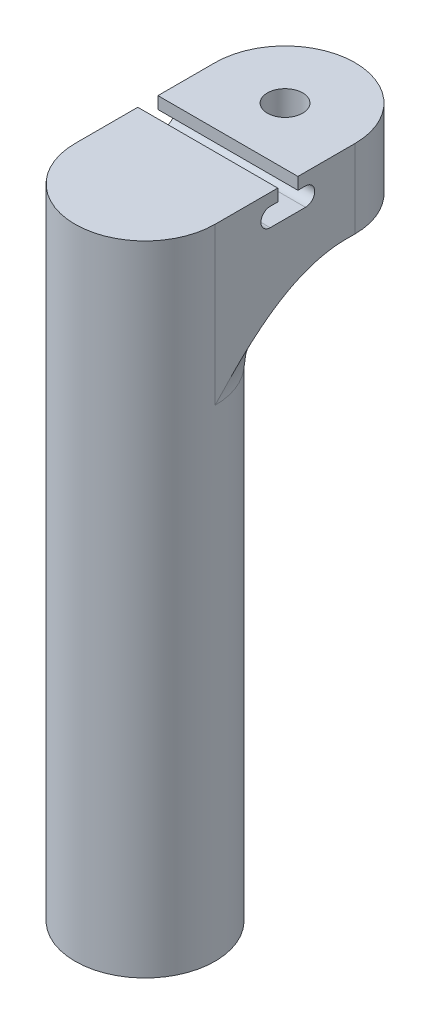
ISO-10303-21;
HEADER;
FILE_DESCRIPTION(('STEP AP214'),'2;1');
FILE_NAME('part.step','',(''),(''),'','','');
FILE_SCHEMA(('AUTOMOTIVE_DESIGN { 1 0 10303 214 1 1 1 1 }'));
ENDSEC;
DATA;
#1=APPLICATION_CONTEXT('core data for automotive mechanical design processes');
#2=APPLICATION_PROTOCOL_DEFINITION('international standard','automotive_design',2000,#1);
#3=PRODUCT_CONTEXT('',#1,'mechanical');
#4=PRODUCT('Part','Part','',(#3));
#5=PRODUCT_RELATED_PRODUCT_CATEGORY('part','',(#4));
#6=PRODUCT_DEFINITION_FORMATION('','',#4);
#7=PRODUCT_DEFINITION_CONTEXT('part definition',#1,'design');
#8=PRODUCT_DEFINITION('design','',#6,#7);
#9=PRODUCT_DEFINITION_SHAPE('','',#8);
#10=(LENGTH_UNIT() NAMED_UNIT(*) SI_UNIT(.MILLI.,.METRE.));
#11=(NAMED_UNIT(*) PLANE_ANGLE_UNIT() SI_UNIT($,.RADIAN.));
#12=(NAMED_UNIT(*) SI_UNIT($,.STERADIAN.) SOLID_ANGLE_UNIT());
#13=UNCERTAINTY_MEASURE_WITH_UNIT(LENGTH_MEASURE(1.E-05),#10,'distance_accuracy_value','');
#14=(GEOMETRIC_REPRESENTATION_CONTEXT(3) GLOBAL_UNCERTAINTY_ASSIGNED_CONTEXT((#13)) GLOBAL_UNIT_ASSIGNED_CONTEXT((#10,
#11,#12)) REPRESENTATION_CONTEXT('',''));
#15=CARTESIAN_POINT('',(0.,0.,0.));
#16=DIRECTION('',(0.,0.,1.));
#17=DIRECTION('',(1.,0.,0.));
#18=AXIS2_PLACEMENT_3D('',#15,#16,#17);
#19=CARTESIAN_POINT('',(0.,86.,0.));
#20=DIRECTION('',(0.,1.,0.));
#21=DIRECTION('',(0.,0.,1.));
#22=AXIS2_PLACEMENT_3D('',#19,#20,#21);
#23=TOROIDAL_SURFACE('',#22,26.5,14.);
#24=CARTESIAN_POINT('',(5.04907796508432,100.,-26.01455));
#25=CARTESIAN_POINT('',(5.0762610661496,100.000013742848,-25.8793666272089));
#26=CARTESIAN_POINT('',(5.09797845416889,99.9982581936895,-25.7430814367185));
#27=CARTESIAN_POINT('',(5.13041814636234,99.9909821859019,-25.4693141202181));
#28=CARTESIAN_POINT('',(5.14114088044935,99.985461874497,-25.3318320412208));
#29=CARTESIAN_POINT('',(5.15151783876317,99.9704472773671,-25.0569822148479));
#30=CARTESIAN_POINT('',(5.15119737223602,99.9609621277391,-24.9196149274924));
#31=CARTESIAN_POINT('',(5.13962580898109,99.9379034955453,-24.6456917861143));
#32=CARTESIAN_POINT('',(5.12837507151366,99.9243301473621,-24.5091359055705));
#33=CARTESIAN_POINT('',(5.09511587383147,99.8930665639615,-24.2377747547514));
#34=CARTESIAN_POINT('',(5.07310400591769,99.8753750255778,-24.1029700529081));
#35=CARTESIAN_POINT('',(5.01859366287669,99.8359511898401,-23.8360500431003));
#36=CARTESIAN_POINT('',(4.9860912943574,99.8142173935336,-23.703935753025));
#37=CARTESIAN_POINT('',(4.91098643654079,99.7669063989532,-23.4433721167089));
#38=CARTESIAN_POINT('',(4.86838747897529,99.7413305457528,-23.3149215064952));
#39=CARTESIAN_POINT('',(4.77350411005985,99.6866046518461,-23.0623824547448));
#40=CARTESIAN_POINT('',(4.72121594660065,99.6574532279968,-22.9382957253286));
#41=CARTESIAN_POINT('',(4.60644734365933,99.5954225166922,-22.6931000199819));
#42=CARTESIAN_POINT('',(4.5438039178149,99.5624867137839,-22.5720817130063));
#43=CARTESIAN_POINT('',(4.40950702574477,99.4937951955356,-22.3359419367481));
#44=CARTESIAN_POINT('',(4.33785050991832,99.4580385272827,-22.2208224819986));
#45=CARTESIAN_POINT('',(4.18604588570146,99.3842790838464,-21.9970334312833));
#46=CARTESIAN_POINT('',(4.10589502739516,99.3462755830558,-21.8883659419172));
#47=CARTESIAN_POINT('',(3.9376229174457,99.2686862534208,-21.6779866422301));
#48=CARTESIAN_POINT('',(3.84950113308384,99.2291003189169,-21.5762752976062));
#49=CARTESIAN_POINT('',(3.65833837011382,99.1458426192627,-21.3723089843838));
#50=CARTESIAN_POINT('',(3.5546672792183,99.1020990155495,-21.2706731247351));
#51=CARTESIAN_POINT('',(3.33915165992659,99.0146442732805,-21.0765325859229));
#52=CARTESIAN_POINT('',(3.22730947695518,98.9709331290183,-20.9840253042805));
#53=CARTESIAN_POINT('',(2.99583153358104,98.8846065117208,-20.8085076090868));
#54=CARTESIAN_POINT('',(2.8761889419204,98.8419920459172,-20.725505700115));
#55=CARTESIAN_POINT('',(2.62969022900545,98.7591108403304,-20.5695936941485));
#56=CARTESIAN_POINT('',(2.50283292033246,98.7188444892282,-20.4966852651882));
#57=CARTESIAN_POINT('',(2.23801312364748,98.6406559199613,-20.3592235380573));
#58=CARTESIAN_POINT('',(2.09981907177053,98.6028612719605,-20.2950420565776));
#59=CARTESIAN_POINT('',(1.81716043847567,98.5327203298068,-20.1788217103962));
#60=CARTESIAN_POINT('',(1.67269952146076,98.5003709042857,-20.1267758602121));
#61=CARTESIAN_POINT('',(1.37865289791335,98.4426306820277,-20.0355796815317));
#62=CARTESIAN_POINT('',(1.22907579898188,98.41722878754,-19.9964087666122));
#63=CARTESIAN_POINT('',(0.925885177684394,98.3746538576017,-19.9315436164633));
#64=CARTESIAN_POINT('',(0.772272665688989,98.3574787826807,-19.9058460409747));
#65=CARTESIAN_POINT('',(0.484139011877502,98.3340901549833,-19.8710479531772));
#66=CARTESIAN_POINT('',(0.349930575093664,98.3266851944806,-19.860137569578));
#67=CARTESIAN_POINT('',(0.0808710654441896,98.3190402066997,-19.8488755998125));
#68=CARTESIAN_POINT('',(-0.0539799421153995,98.3187994662087,-19.848522962601));
#69=CARTESIAN_POINT('',(-0.32310677587289,98.3254944726485,-19.8583819923226));
#70=CARTESIAN_POINT('',(-0.457382618762349,98.3324300098838,-19.868593350569));
#71=CARTESIAN_POINT('',(-0.724193169335582,98.3531574089899,-19.8994039785459));
#72=CARTESIAN_POINT('',(-0.85672790037204,98.3669491788048,-19.9200031088041));
#73=CARTESIAN_POINT('',(-1.10554575026102,98.3990492749911,-19.9686335039564));
#74=CARTESIAN_POINT('',(-1.22210109300132,98.4167489997262,-19.9956853575475));
#75=CARTESIAN_POINT('',(-1.45235560036544,98.4566079591168,-20.0575924987316));
#76=CARTESIAN_POINT('',(-1.56605383282588,98.4787686284897,-20.0924502972589));
#77=CARTESIAN_POINT('',(-1.90200115469982,98.550967686065,-20.2082431897258));
#78=CARTESIAN_POINT('',(-2.1192439171723,98.6067426302949,-20.3004258177189));
#79=CARTESIAN_POINT('',(-2.5620413342218,98.7352667643654,-20.5248049540764));
#80=CARTESIAN_POINT('',(-2.78544905887181,98.8092510096401,-20.6604822302676));
#81=CARTESIAN_POINT('',(-3.2084136442203,98.9621025601692,-20.963145653143));
#82=CARTESIAN_POINT('',(-3.40795156076627,99.0409736694908,-21.1301564010346));
#83=CARTESIAN_POINT('',(-3.7002452709909,99.163714412512,-21.4149239570015));
#84=CARTESIAN_POINT('',(-3.80217540633639,99.2081288148149,-21.5232025290608));
#85=CARTESIAN_POINT('',(-3.99655449512563,99.2954312446224,-21.7485129989775));
#86=CARTESIAN_POINT('',(-4.08900644024411,99.3383197509491,-21.8655421145384));
#87=CARTESIAN_POINT('',(-4.26378162706849,99.4216457749782,-22.1077729337814));
#88=CARTESIAN_POINT('',(-4.34610378585232,99.4620830303964,-22.232975509059));
#89=CARTESIAN_POINT('',(-4.49987356086748,99.5396733186006,-22.490786741355));
#90=CARTESIAN_POINT('',(-4.57132601376392,99.5768278090068,-22.623392068272));
#91=CARTESIAN_POINT('',(-4.70198798278653,99.6468110849585,-22.8937907306793));
#92=CARTESIAN_POINT('',(-4.76131818466688,99.6796811982648,-23.031514963027));
#93=CARTESIAN_POINT('',(-4.8679960286818,99.7410115111176,-23.312488896303));
#94=CARTESIAN_POINT('',(-4.91534348044815,99.7694716406005,-23.4557386849733));
#95=CARTESIAN_POINT('',(-4.99743752761666,99.8215816779277,-23.7466243321889));
#96=CARTESIAN_POINT('',(-5.03218709860086,99.8452327210836,-23.8942591460792));
#97=CARTESIAN_POINT('',(-5.08859924602115,99.887493850556,-24.1927108574004));
#98=CARTESIAN_POINT('',(-5.11026308981515,99.9061044249475,-24.3435274452106));
#99=CARTESIAN_POINT('',(-5.13890400867794,99.9368702741881,-24.6343497585326));
#100=CARTESIAN_POINT('',(-5.14695571704122,99.9494346074757,-24.774207524604));
#101=CARTESIAN_POINT('',(-5.15161866086922,99.970326520927,-25.0544280024545));
#102=CARTESIAN_POINT('',(-5.14823034109799,99.9786542657858,-25.1947906943912));
#103=CARTESIAN_POINT('',(-5.12995286320665,99.9912423899475,-25.4752466552403));
#104=CARTESIAN_POINT('',(-5.11503918379695,99.995494053736,-25.6153387104574));
#105=CARTESIAN_POINT('',(-5.07378667716049,100.000170426364,-25.8939086468126));
#106=CARTESIAN_POINT('',(-5.04744681989643,100.000594790107,-26.0323863812686));
#107=CARTESIAN_POINT('',(-5.01544786119926,99.999240784892,-26.1695224459547));
#108=B_SPLINE_CURVE_WITH_KNOTS('',3,(#24,#25,#26,#27,#28,#29,#30,#31,#32,#33,#34,#35,#36,#37,
#38,#39,#40,#41,#42,#43,#44,#45,#46,#47,#48,#49,#50,#51,#52,#53,#54,#55,#56,#57,#58,#59,#60,#61,
#62,#63,#64,#65,#66,#67,#68,#69,#70,#71,#72,#73,#74,#75,#76,#77,#78,#79,#80,#81,#82,#83,#84,#85,
#86,#87,#88,#89,#90,#91,#92,#93,#94,#95,#96,#97,#98,#99,#100,#101,#102,#103,#104,#105,#106,
#107),.UNSPECIFIED.,.F.,.F.,(4,2,2,2,2,2,2,2,2,2,2,2,2,2,2,2,2,2,2,2,2,2,2,2,2,2,2,2,2,2,2,2,2,
2,2,2,2,2,2,2,2,4),(0.,0.413549712994737,0.827083254756278,1.23966910708221,1.65224139883685,
2.06494442348922,2.4778007931493,2.89051296048116,3.30338528434379,3.72351423030304,
4.14378571223211,4.56419366877957,4.98462974312573,5.43901050828138,5.8932613568668,
6.34791550566108,6.80264470050056,7.27295270693983,7.74298932381497,8.21227067583405,
8.68143563032241,9.08541730432539,9.48935876099248,9.89328841456435,10.2972126448821,
10.6596931340014,11.0222903899543,11.7470540737806,12.5590545255424,13.3716952009607,
13.8368274364149,14.3018124036163,14.7668470368036,15.2316741356259,15.6916200068215,
16.1515731846527,16.6114176520191,17.0712175761207,17.4926518754042,17.9140697904033,
18.3363867885636,18.7587418653092),.UNSPECIFIED.);
#109=CARTESIAN_POINT('',(5.04907796508432,100.,-26.01455));
#110=VERTEX_POINT('',#109);
#111=CARTESIAN_POINT('',(-5.04907796508432,100.,-26.01455));
#112=VERTEX_POINT('',#111);
#113=EDGE_CURVE('E360',#110,#112,#108,.T.);
#114=ORIENTED_EDGE('',*,*,#113,.F.);
#115=CARTESIAN_POINT('',(0.,100.,0.));
#116=DIRECTION('',(0.,1.,0.));
#117=DIRECTION('',(0.,0.,1.));
#118=AXIS2_PLACEMENT_3D('',#115,#116,#117);
#119=CIRCLE('',#118,26.5);
#120=CARTESIAN_POINT('',(12.5,100.,-23.3666428910959));
#121=VERTEX_POINT('',#120);
#122=EDGE_CURVE('E351',#121,#110,#119,.T.);
#123=ORIENTED_EDGE('',*,*,#122,.F.);
#124=CARTESIAN_POINT('',(12.5,100.,-23.3666428910959));
#125=CARTESIAN_POINT('',(12.5,100.000001251155,-23.083094663131));
#126=CARTESIAN_POINT('',(12.5,99.9933015505005,-22.7995977515363));
#127=CARTESIAN_POINT('',(12.5,99.9668587758662,-22.2332541391649));
#128=CARTESIAN_POINT('',(12.5,99.9471177133723,-21.9504073448651));
#129=CARTESIAN_POINT('',(12.5,99.868947869374,-21.1044079620911));
#130=CARTESIAN_POINT('',(12.5,99.7915701563818,-20.5429135353648));
#131=CARTESIAN_POINT('',(12.5,99.5907097181542,-19.4347930296872));
#132=CARTESIAN_POINT('',(12.5,99.4677445888395,-18.8880712832982));
#133=CARTESIAN_POINT('',(12.5,99.1791337740243,-17.8058418733705));
#134=CARTESIAN_POINT('',(12.5,99.0134695554496,-17.2703391887479));
#135=CARTESIAN_POINT('',(12.5,98.5804354497702,-16.033851870729));
#136=CARTESIAN_POINT('',(12.5,98.2976229725125,-15.3382595684696));
#137=CARTESIAN_POINT('',(12.5,97.6713158543407,-13.9750568846442));
#138=CARTESIAN_POINT('',(12.5,97.3278047568973,-13.3074541524593));
#139=CARTESIAN_POINT('',(12.5,96.5876480463145,-11.9989205722143));
#140=CARTESIAN_POINT('',(12.5,96.1907869070001,-11.3581125089503));
#141=CARTESIAN_POINT('',(12.5,95.3536386394992,-10.1053739516389));
#142=CARTESIAN_POINT('',(12.5,94.9133352967001,-9.49345436704268));
#143=CARTESIAN_POINT('',(12.5,94.1449386346151,-8.4891521865242));
#144=CARTESIAN_POINT('',(12.5,93.826298261986,-8.08945587405815));
#145=CARTESIAN_POINT('',(12.5,93.1753239536066,-7.30155658067723));
#146=CARTESIAN_POINT('',(12.5,92.8429933338274,-6.91335085527519));
#147=CARTESIAN_POINT('',(12.5,91.8284903212038,-5.76372325645531));
#148=CARTESIAN_POINT('',(12.5,91.1290246427347,-5.01756996980459));
#149=CARTESIAN_POINT('',(12.5,88.9877594848668,-2.82367715175982));
#150=CARTESIAN_POINT('',(12.5,87.5022659214507,-1.41950982944029));
#151=CARTESIAN_POINT('',(12.5,86.0114668325127,-0.0108351372254986));
#152=CARTESIAN_POINT('',(12.5,86.0057334113781,-0.00541756347535301));
#153=CARTESIAN_POINT('',(12.5,86.,0.));
#154=B_SPLINE_CURVE_WITH_KNOTS('',3,(#124,#125,#126,#127,#128,#129,#130,#131,#132,#133,#134,
#135,#136,#137,#138,#139,#140,#141,#142,#143,#144,#145,#146,#147,#148,#149,#150,#151,#152,#153),
.UNSPECIFIED.,.F.,.F.,(4,2,2,2,2,2,2,2,2,2,2,2,2,2,4),(0.,0.850472118412875,1.70081309151973,
3.39885641928183,5.07818297997625,6.75823966511301,9.00741190393508,11.2571948735966,
13.5163562394423,15.7763640404441,17.309545004503,18.8423567691994,21.9090402918385,
28.0385444440093,28.0622087631415),.UNSPECIFIED.);
#155=CARTESIAN_POINT('',(12.5,86.,0.));
#156=VERTEX_POINT('',#155);
#157=EDGE_CURVE('E52',#121,#156,#154,.T.);
#158=ORIENTED_EDGE('',*,*,#157,.T.);
#159=CARTESIAN_POINT('',(0.,86.,0.));
#160=DIRECTION('',(0.,1.,0.));
#161=DIRECTION('',(0.,0.,1.));
#162=AXIS2_PLACEMENT_3D('',#159,#160,#161);
#163=CIRCLE('',#162,12.5);
#164=CARTESIAN_POINT('',(2.38164054956808,86.,-12.2710141509434));
#165=VERTEX_POINT('',#164);
#166=EDGE_CURVE('E66',#165,#156,#163,.F.);
#167=ORIENTED_EDGE('',*,*,#166,.F.);
#168=CARTESIAN_POINT('',(0.,86.,0.));
#169=DIRECTION('',(0.,1.,0.));
#170=DIRECTION('',(0.,0.,1.));
#171=AXIS2_PLACEMENT_3D('',#168,#169,#170);
#172=CIRCLE('',#171,12.5);
#173=CARTESIAN_POINT('',(-12.5,86.,0.));
#174=VERTEX_POINT('',#173);
#175=EDGE_CURVE('E355',#174,#165,#172,.F.);
#176=ORIENTED_EDGE('',*,*,#175,.F.);
#177=CARTESIAN_POINT('',(-12.5,100.,-23.3666428910959));
#178=CARTESIAN_POINT('',(-12.5,100.000001251155,-23.083094663131));
#179=CARTESIAN_POINT('',(-12.5,99.9933015505005,-22.7995977515363));
#180=CARTESIAN_POINT('',(-12.5,99.9668587758662,-22.2332541391649));
#181=CARTESIAN_POINT('',(-12.5,99.9471177133723,-21.9504073448651));
#182=CARTESIAN_POINT('',(-12.5,99.868947869374,-21.1044079620911));
#183=CARTESIAN_POINT('',(-12.5,99.7915701563818,-20.5429135353648));
#184=CARTESIAN_POINT('',(-12.5,99.5907097181542,-19.4347930296872));
#185=CARTESIAN_POINT('',(-12.5,99.4677445888395,-18.8880712832982));
#186=CARTESIAN_POINT('',(-12.5,99.1791337740243,-17.8058418733705));
#187=CARTESIAN_POINT('',(-12.5,99.0134695554496,-17.2703391887479));
#188=CARTESIAN_POINT('',(-12.5,98.5804354497702,-16.033851870729));
#189=CARTESIAN_POINT('',(-12.5,98.2976229725125,-15.3382595684696));
#190=CARTESIAN_POINT('',(-12.5,97.6713158543407,-13.9750568846442));
#191=CARTESIAN_POINT('',(-12.5,97.3278047568973,-13.3074541524593));
#192=CARTESIAN_POINT('',(-12.5,96.5876480463145,-11.9989205722143));
#193=CARTESIAN_POINT('',(-12.5,96.1907869070001,-11.3581125089503));
#194=CARTESIAN_POINT('',(-12.5,95.3536386394992,-10.1053739516389));
#195=CARTESIAN_POINT('',(-12.5,94.9133352967001,-9.49345436704268));
#196=CARTESIAN_POINT('',(-12.5,94.1449386346151,-8.4891521865242));
#197=CARTESIAN_POINT('',(-12.5,93.826298261986,-8.08945587405815));
#198=CARTESIAN_POINT('',(-12.5,93.1753239536066,-7.30155658067723));
#199=CARTESIAN_POINT('',(-12.5,92.8429933338274,-6.91335085527519));
#200=CARTESIAN_POINT('',(-12.5,91.8284903212038,-5.76372325645531));
#201=CARTESIAN_POINT('',(-12.5,91.1290246427347,-5.01756996980459));
#202=CARTESIAN_POINT('',(-12.5,88.9877594848668,-2.82367715175982));
#203=CARTESIAN_POINT('',(-12.5,87.5022659214507,-1.41950982944029));
#204=CARTESIAN_POINT('',(-12.5,86.0114668325127,-0.0108351372254986));
#205=CARTESIAN_POINT('',(-12.5,86.0057334113781,-0.00541756347535301));
#206=CARTESIAN_POINT('',(-12.5,86.,0.));
#207=B_SPLINE_CURVE_WITH_KNOTS('',3,(#177,#178,#179,#180,#181,#182,#183,#184,#185,#186,#187,
#188,#189,#190,#191,#192,#193,#194,#195,#196,#197,#198,#199,#200,#201,#202,#203,#204,#205,#206),
.UNSPECIFIED.,.F.,.F.,(4,2,2,2,2,2,2,2,2,2,2,2,2,2,4),(0.,0.850472118412875,1.70081309151973,
3.39885641928183,5.07818297997625,6.75823966511301,9.00741190393508,11.2571948735966,
13.5163562394423,15.7763640404441,17.309545004503,18.8423567691994,21.9090402918385,
28.0385444440093,28.0622087631415),.UNSPECIFIED.);
#208=CARTESIAN_POINT('',(-12.5,100.,-23.3666428910959));
#209=VERTEX_POINT('',#208);
#210=EDGE_CURVE('E11',#174,#209,#207,.F.);
#211=ORIENTED_EDGE('',*,*,#210,.T.);
#212=CARTESIAN_POINT('',(0.,100.,0.));
#213=DIRECTION('',(0.,1.,0.));
#214=DIRECTION('',(0.,0.,1.));
#215=AXIS2_PLACEMENT_3D('',#212,#213,#214);
#216=CIRCLE('',#215,26.5);
#217=EDGE_CURVE('E347',#112,#209,#216,.T.);
#218=ORIENTED_EDGE('',*,*,#217,.F.);
#219=EDGE_LOOP('',(#114,#123,#158,#167,#176,#211,#218));
#220=FACE_BOUND('',#219,.T.);
#221=ADVANCED_FACE('F38',(#220),#23,.F.);
#222=CARTESIAN_POINT('',(0.,114.,0.));
#223=DIRECTION('',(0.,1.,0.));
#224=DIRECTION('',(0.,0.,1.));
#225=AXIS2_PLACEMENT_3D('',#222,#223,#224);
#226=PLANE('',#225);
#227=DIRECTION('',(1.,0.,0.));
#228=VECTOR('',#227,1.);
#229=CARTESIAN_POINT('',(-23.5391349298756,114.,-11.2));
#230=LINE('',#229,#228);
#231=CARTESIAN_POINT('',(-12.5,114.,-11.2));
#232=VERTEX_POINT('',#231);
#233=CARTESIAN_POINT('',(12.5,114.,-11.2));
#234=VERTEX_POINT('',#233);
#235=EDGE_CURVE('E225',#232,#234,#230,.T.);
#236=ORIENTED_EDGE('',*,*,#235,.F.);
#237=DIRECTION('',(0.,0.,1.));
#238=VECTOR('',#237,1.);
#239=CARTESIAN_POINT('',(-12.5,114.,0.));
#240=LINE('',#239,#238);
#241=CARTESIAN_POINT('',(-12.5,114.,0.));
#242=VERTEX_POINT('',#241);
#243=EDGE_CURVE('E273',#232,#242,#240,.T.);
#244=ORIENTED_EDGE('',*,*,#243,.T.);
#245=CARTESIAN_POINT('',(0.,114.,0.));
#246=DIRECTION('',(0.,1.,0.));
#247=DIRECTION('',(0.,0.,1.));
#248=AXIS2_PLACEMENT_3D('',#245,#246,#247);
#249=CIRCLE('',#248,12.5);
#250=CARTESIAN_POINT('',(12.5,114.,0.));
#251=VERTEX_POINT('',#250);
#252=EDGE_CURVE('E260',#242,#251,#249,.T.);
#253=ORIENTED_EDGE('',*,*,#252,.T.);
#254=DIRECTION('',(0.,0.,-1.));
#255=VECTOR('',#254,1.);
#256=CARTESIAN_POINT('',(12.5,114.,0.));
#257=LINE('',#256,#255);
#258=EDGE_CURVE('E266',#251,#234,#257,.T.);
#259=ORIENTED_EDGE('',*,*,#258,.T.);
#260=EDGE_LOOP('',(#236,#244,#253,#259));
#261=FACE_BOUND('',#260,.T.);
#262=ADVANCED_FACE('F385',(#261),#226,.T.);
#263=CARTESIAN_POINT('',(0.,100.,0.));
#264=DIRECTION('',(0.,-1.,0.));
#265=DIRECTION('',(0.,0.,-1.));
#266=AXIS2_PLACEMENT_3D('',#263,#264,#265);
#267=CYLINDRICAL_SURFACE('',#266,12.5);
#268=ORIENTED_EDGE('',*,*,#166,.T.);
#269=DIRECTION('',(0.,-1.,0.));
#270=VECTOR('',#269,1.);
#271=CARTESIAN_POINT('',(12.5,114.,0.));
#272=LINE('',#271,#270);
#273=EDGE_CURVE('E59',#251,#156,#272,.T.);
#274=ORIENTED_EDGE('',*,*,#273,.F.);
#275=ORIENTED_EDGE('',*,*,#252,.F.);
#276=DIRECTION('',(0.,-1.,0.));
#277=VECTOR('',#276,1.);
#278=CARTESIAN_POINT('',(-12.5,114.,0.));
#279=LINE('',#278,#277);
#280=EDGE_CURVE('E278',#242,#174,#279,.T.);
#281=ORIENTED_EDGE('',*,*,#280,.T.);
#282=ORIENTED_EDGE('',*,*,#175,.T.);
#283=EDGE_LOOP('',(#268,#274,#275,#281,#282));
#284=FACE_BOUND('',#283,.T.);
#285=CARTESIAN_POINT('',(0.,0.,0.));
#286=DIRECTION('',(0.,1.,0.));
#287=DIRECTION('',(0.,0.,1.));
#288=AXIS2_PLACEMENT_3D('',#285,#286,#287);
#289=CIRCLE('',#288,12.5);
#290=CARTESIAN_POINT('',(0.,0.,12.5));
#291=VERTEX_POINT('',#290);
#292=EDGE_CURVE('E334',#291,#291,#289,.T.);
#293=ORIENTED_EDGE('',*,*,#292,.T.);
#294=EDGE_LOOP('',(#293));
#295=FACE_BOUND('',#294,.T.);
#296=ADVANCED_FACE('F421',(#284,#295),#267,.T.);
#297=CARTESIAN_POINT('',(0.,0.,0.));
#298=DIRECTION('',(0.,1.,0.));
#299=DIRECTION('',(0.,0.,1.));
#300=AXIS2_PLACEMENT_3D('',#297,#298,#299);
#301=PLANE('',#300);
#302=DIRECTION('',(1.,0.,0.));
#303=VECTOR('',#302,1.);
#304=CARTESIAN_POINT('',(4.1,0.,-4.1));
#305=LINE('',#304,#303);
#306=CARTESIAN_POINT('',(-4.1,0.,-4.1));
#307=VERTEX_POINT('',#306);
#308=CARTESIAN_POINT('',(4.1,0.,-4.1));
#309=VERTEX_POINT('',#308);
#310=EDGE_CURVE('E320',#307,#309,#305,.T.);
#311=ORIENTED_EDGE('',*,*,#310,.F.);
#312=DIRECTION('',(0.,0.,-1.));
#313=VECTOR('',#312,1.);
#314=CARTESIAN_POINT('',(-4.1,0.,-4.1));
#315=LINE('',#314,#313);
#316=CARTESIAN_POINT('',(-4.1,0.,4.1));
#317=VERTEX_POINT('',#316);
#318=EDGE_CURVE('E299',#317,#307,#315,.T.);
#319=ORIENTED_EDGE('',*,*,#318,.F.);
#320=DIRECTION('',(-1.,0.,0.));
#321=VECTOR('',#320,1.);
#322=CARTESIAN_POINT('',(4.1,0.,4.1));
#323=LINE('',#322,#321);
#324=CARTESIAN_POINT('',(4.1,0.,4.1));
#325=VERTEX_POINT('',#324);
#326=EDGE_CURVE('E305',#325,#317,#323,.T.);
#327=ORIENTED_EDGE('',*,*,#326,.F.);
#328=DIRECTION('',(0.,0.,1.));
#329=VECTOR('',#328,1.);
#330=CARTESIAN_POINT('',(4.1,0.,-4.1));
#331=LINE('',#330,#329);
#332=EDGE_CURVE('E324',#309,#325,#331,.T.);
#333=ORIENTED_EDGE('',*,*,#332,.F.);
#334=EDGE_LOOP('',(#311,#319,#327,#333));
#335=FACE_BOUND('',#334,.T.);
#336=ORIENTED_EDGE('',*,*,#292,.F.);
#337=EDGE_LOOP('',(#336));
#338=FACE_BOUND('',#337,.T.);
#339=ADVANCED_FACE('F418',(#335,#338),#301,.F.);
#340=CARTESIAN_POINT('',(-4.1,20.,-4.1));
#341=DIRECTION('',(-1.,0.,0.));
#342=DIRECTION('',(0.,0.,1.));
#343=AXIS2_PLACEMENT_3D('',#340,#341,#342);
#344=PLANE('',#343);
#345=ORIENTED_EDGE('',*,*,#318,.T.);
#346=DIRECTION('',(0.,-1.,0.));
#347=VECTOR('',#346,1.);
#348=CARTESIAN_POINT('',(-4.1,20.,-4.1));
#349=LINE('',#348,#347);
#350=CARTESIAN_POINT('',(-4.1,20.,-4.1));
#351=VERTEX_POINT('',#350);
#352=EDGE_CURVE('E317',#351,#307,#349,.T.);
#353=ORIENTED_EDGE('',*,*,#352,.F.);
#354=DIRECTION('',(0.,0.,-1.));
#355=VECTOR('',#354,1.);
#356=CARTESIAN_POINT('',(-4.1,20.,-4.1));
#357=LINE('',#356,#355);
#358=CARTESIAN_POINT('',(-4.1,20.,4.1));
#359=VERTEX_POINT('',#358);
#360=EDGE_CURVE('E300',#359,#351,#357,.T.);
#361=ORIENTED_EDGE('',*,*,#360,.F.);
#362=DIRECTION('',(0.,-1.,0.));
#363=VECTOR('',#362,1.);
#364=CARTESIAN_POINT('',(-4.1,20.,4.1));
#365=LINE('',#364,#363);
#366=EDGE_CURVE('E331',#359,#317,#365,.T.);
#367=ORIENTED_EDGE('',*,*,#366,.T.);
#368=EDGE_LOOP('',(#345,#353,#361,#367));
#369=FACE_BOUND('',#368,.T.);
#370=ADVANCED_FACE('F408',(#369),#344,.F.);
#371=CARTESIAN_POINT('',(4.1,20.,4.1));
#372=DIRECTION('',(0.,0.,1.));
#373=DIRECTION('',(1.,0.,0.));
#374=AXIS2_PLACEMENT_3D('',#371,#372,#373);
#375=PLANE('',#374);
#376=ORIENTED_EDGE('',*,*,#326,.T.);
#377=ORIENTED_EDGE('',*,*,#366,.F.);
#378=DIRECTION('',(-1.,0.,0.));
#379=VECTOR('',#378,1.);
#380=CARTESIAN_POINT('',(4.1,20.,4.1));
#381=LINE('',#380,#379);
#382=CARTESIAN_POINT('',(4.1,20.,4.1));
#383=VERTEX_POINT('',#382);
#384=EDGE_CURVE('E313',#383,#359,#381,.T.);
#385=ORIENTED_EDGE('',*,*,#384,.F.);
#386=DIRECTION('',(0.,-1.,0.));
#387=VECTOR('',#386,1.);
#388=CARTESIAN_POINT('',(4.1,20.,4.1));
#389=LINE('',#388,#387);
#390=EDGE_CURVE('E335',#383,#325,#389,.T.);
#391=ORIENTED_EDGE('',*,*,#390,.T.);
#392=EDGE_LOOP('',(#376,#377,#385,#391));
#393=FACE_BOUND('',#392,.T.);
#394=ADVANCED_FACE('F404',(#393),#375,.F.);
#395=CARTESIAN_POINT('',(4.1,20.,-4.1));
#396=DIRECTION('',(1.,0.,0.));
#397=DIRECTION('',(0.,0.,-1.));
#398=AXIS2_PLACEMENT_3D('',#395,#396,#397);
#399=PLANE('',#398);
#400=ORIENTED_EDGE('',*,*,#332,.T.);
#401=ORIENTED_EDGE('',*,*,#390,.F.);
#402=DIRECTION('',(0.,0.,1.));
#403=VECTOR('',#402,1.);
#404=CARTESIAN_POINT('',(4.1,20.,-4.1));
#405=LINE('',#404,#403);
#406=CARTESIAN_POINT('',(4.1,20.,-4.1));
#407=VERTEX_POINT('',#406);
#408=EDGE_CURVE('E309',#407,#383,#405,.T.);
#409=ORIENTED_EDGE('',*,*,#408,.F.);
#410=DIRECTION('',(0.,-1.,0.));
#411=VECTOR('',#410,1.);
#412=CARTESIAN_POINT('',(4.1,20.,-4.1));
#413=LINE('',#412,#411);
#414=EDGE_CURVE('E338',#407,#309,#413,.T.);
#415=ORIENTED_EDGE('',*,*,#414,.T.);
#416=EDGE_LOOP('',(#400,#401,#409,#415));
#417=FACE_BOUND('',#416,.T.);
#418=ADVANCED_FACE('F407',(#417),#399,.F.);
#419=CARTESIAN_POINT('',(4.1,20.,-4.1));
#420=DIRECTION('',(0.,0.,-1.));
#421=DIRECTION('',(-1.,0.,0.));
#422=AXIS2_PLACEMENT_3D('',#419,#420,#421);
#423=PLANE('',#422);
#424=ORIENTED_EDGE('',*,*,#310,.T.);
#425=ORIENTED_EDGE('',*,*,#414,.F.);
#426=DIRECTION('',(1.,0.,0.));
#427=VECTOR('',#426,1.);
#428=CARTESIAN_POINT('',(4.1,20.,-4.1));
#429=LINE('',#428,#427);
#430=EDGE_CURVE('E304',#351,#407,#429,.T.);
#431=ORIENTED_EDGE('',*,*,#430,.F.);
#432=ORIENTED_EDGE('',*,*,#352,.T.);
#433=EDGE_LOOP('',(#424,#425,#431,#432));
#434=FACE_BOUND('',#433,.T.);
#435=ADVANCED_FACE('F402',(#434),#423,.F.);
#436=CARTESIAN_POINT('',(0.,20.,0.));
#437=DIRECTION('',(0.,-1.,0.));
#438=DIRECTION('',(0.,0.,-1.));
#439=AXIS2_PLACEMENT_3D('',#436,#437,#438);
#440=PLANE('',#439);
#441=ORIENTED_EDGE('',*,*,#360,.T.);
#442=ORIENTED_EDGE('',*,*,#430,.T.);
#443=ORIENTED_EDGE('',*,*,#408,.T.);
#444=ORIENTED_EDGE('',*,*,#384,.T.);
#445=EDGE_LOOP('',(#441,#442,#443,#444));
#446=FACE_BOUND('',#445,.T.);
#447=ADVANCED_FACE('F388',(#446),#440,.T.);
#448=CARTESIAN_POINT('',(0.,100.,0.));
#449=DIRECTION('',(0.,1.,0.));
#450=DIRECTION('',(0.,0.,1.));
#451=AXIS2_PLACEMENT_3D('',#448,#449,#450);
#452=PLANE('',#451);
#453=DIRECTION('',(0.,0.,-1.));
#454=VECTOR('',#453,1.);
#455=CARTESIAN_POINT('',(12.5,100.,0.));
#456=LINE('',#455,#454);
#457=CARTESIAN_POINT('',(12.5,100.,-25.));
#458=VERTEX_POINT('',#457);
#459=EDGE_CURVE('E256',#121,#458,#456,.T.);
#460=ORIENTED_EDGE('',*,*,#459,.F.);
#461=ORIENTED_EDGE('',*,*,#122,.T.);
#462=CARTESIAN_POINT('',(0.,100.,-25.));
#463=DIRECTION('',(0.,-1.,0.));
#464=DIRECTION('',(0.,0.,-1.));
#465=AXIS2_PLACEMENT_3D('',#462,#463,#464);
#466=CIRCLE('',#465,5.15);
#467=EDGE_CURVE('E251',#112,#110,#466,.T.);
#468=ORIENTED_EDGE('',*,*,#467,.F.);
#469=ORIENTED_EDGE('',*,*,#217,.T.);
#470=DIRECTION('',(0.,0.,1.));
#471=VECTOR('',#470,1.);
#472=CARTESIAN_POINT('',(-12.5,100.,0.));
#473=LINE('',#472,#471);
#474=CARTESIAN_POINT('',(-12.5,100.,-25.));
#475=VERTEX_POINT('',#474);
#476=EDGE_CURVE('E265',#475,#209,#473,.T.);
#477=ORIENTED_EDGE('',*,*,#476,.F.);
#478=CARTESIAN_POINT('',(0.,100.,-25.));
#479=DIRECTION('',(0.,1.,0.));
#480=DIRECTION('',(0.,0.,1.));
#481=AXIS2_PLACEMENT_3D('',#478,#479,#480);
#482=CIRCLE('',#481,12.5);
#483=EDGE_CURVE('E281',#458,#475,#482,.T.);
#484=ORIENTED_EDGE('',*,*,#483,.F.);
#485=EDGE_LOOP('',(#460,#461,#468,#469,#477,#484));
#486=FACE_BOUND('',#485,.T.);
#487=ADVANCED_FACE('F386',(#486),#452,.F.);
#488=CARTESIAN_POINT('',(12.5,114.,0.));
#489=DIRECTION('',(-1.,0.,0.));
#490=DIRECTION('',(0.,0.,1.));
#491=AXIS2_PLACEMENT_3D('',#488,#489,#490);
#492=PLANE('',#491);
#493=DIRECTION('',(0.,0.,1.));
#494=VECTOR('',#493,1.);
#495=CARTESIAN_POINT('',(12.5,111.85,-9.85));
#496=LINE('',#495,#494);
#497=CARTESIAN_POINT('',(12.5,111.85,-11.2));
#498=VERTEX_POINT('',#497);
#499=CARTESIAN_POINT('',(12.5,111.85,-9.85));
#500=VERTEX_POINT('',#499);
#501=EDGE_CURVE('E185',#498,#500,#496,.T.);
#502=ORIENTED_EDGE('',*,*,#501,.F.);
#503=DIRECTION('',(0.,-1.,0.));
#504=VECTOR('',#503,1.);
#505=CARTESIAN_POINT('',(12.5,114.,-11.2));
#506=LINE('',#505,#504);
#507=EDGE_CURVE('E213',#234,#498,#506,.T.);
#508=ORIENTED_EDGE('',*,*,#507,.F.);
#509=ORIENTED_EDGE('',*,*,#258,.F.);
#510=ORIENTED_EDGE('',*,*,#273,.T.);
#511=ORIENTED_EDGE('',*,*,#157,.F.);
#512=ORIENTED_EDGE('',*,*,#459,.T.);
#513=DIRECTION('',(0.,-1.,0.));
#514=VECTOR('',#513,1.);
#515=CARTESIAN_POINT('',(12.5,114.,-25.));
#516=LINE('',#515,#514);
#517=CARTESIAN_POINT('',(12.5,114.,-25.));
#518=VERTEX_POINT('',#517);
#519=EDGE_CURVE('E293',#518,#458,#516,.T.);
#520=ORIENTED_EDGE('',*,*,#519,.F.);
#521=CARTESIAN_POINT('',(12.5,114.,-14.8));
#522=VERTEX_POINT('',#521);
#523=EDGE_CURVE('E264',#522,#518,#257,.T.);
#524=ORIENTED_EDGE('',*,*,#523,.F.);
#525=DIRECTION('',(0.,1.,0.));
#526=VECTOR('',#525,1.);
#527=CARTESIAN_POINT('',(12.5,114.,-14.8));
#528=LINE('',#527,#526);
#529=CARTESIAN_POINT('',(12.5,111.85,-14.8));
#530=VERTEX_POINT('',#529);
#531=EDGE_CURVE('E210',#530,#522,#528,.T.);
#532=ORIENTED_EDGE('',*,*,#531,.F.);
#533=DIRECTION('',(0.,0.,1.));
#534=VECTOR('',#533,1.);
#535=CARTESIAN_POINT('',(12.5,111.85,-14.8));
#536=LINE('',#535,#534);
#537=CARTESIAN_POINT('',(12.5,111.85,-16.15));
#538=VERTEX_POINT('',#537);
#539=EDGE_CURVE('E203',#538,#530,#536,.T.);
#540=ORIENTED_EDGE('',*,*,#539,.F.);
#541=CARTESIAN_POINT('',(12.5,110.2,-16.15));
#542=DIRECTION('',(1.,0.,0.));
#543=DIRECTION('',(0.,0.,-1.));
#544=AXIS2_PLACEMENT_3D('',#541,#542,#543);
#545=CIRCLE('',#544,1.65);
#546=CARTESIAN_POINT('',(12.5,108.55,-16.15));
#547=VERTEX_POINT('',#546);
#548=EDGE_CURVE('E199',#547,#538,#545,.T.);
#549=ORIENTED_EDGE('',*,*,#548,.F.);
#550=DIRECTION('',(0.,0.,-1.));
#551=VECTOR('',#550,1.);
#552=CARTESIAN_POINT('',(12.5,108.55,-9.85));
#553=LINE('',#552,#551);
#554=CARTESIAN_POINT('',(12.5,108.55,-9.85));
#555=VERTEX_POINT('',#554);
#556=EDGE_CURVE('E177',#555,#547,#553,.T.);
#557=ORIENTED_EDGE('',*,*,#556,.F.);
#558=CARTESIAN_POINT('',(12.5,110.2,-9.85));
#559=DIRECTION('',(1.,0.,0.));
#560=DIRECTION('',(0.,0.,-1.));
#561=AXIS2_PLACEMENT_3D('',#558,#559,#560);
#562=CIRCLE('',#561,1.65);
#563=EDGE_CURVE('E188',#500,#555,#562,.T.);
#564=ORIENTED_EDGE('',*,*,#563,.F.);
#565=EDGE_LOOP('',(#502,#508,#509,#510,#511,#512,#520,#524,#532,#540,#549,#557,#564));
#566=FACE_BOUND('',#565,.T.);
#567=ADVANCED_FACE('F196',(#566),#492,.F.);
#568=CARTESIAN_POINT('',(0.,114.,-25.));
#569=DIRECTION('',(0.,-1.,0.));
#570=DIRECTION('',(0.,0.,-1.));
#571=AXIS2_PLACEMENT_3D('',#568,#569,#570);
#572=CYLINDRICAL_SURFACE('',#571,12.5);
#573=ORIENTED_EDGE('',*,*,#483,.T.);
#574=DIRECTION('',(0.,-1.,0.));
#575=VECTOR('',#574,1.);
#576=CARTESIAN_POINT('',(-12.5,114.,-25.));
#577=LINE('',#576,#575);
#578=CARTESIAN_POINT('',(-12.5,114.,-25.));
#579=VERTEX_POINT('',#578);
#580=EDGE_CURVE('E289',#579,#475,#577,.T.);
#581=ORIENTED_EDGE('',*,*,#580,.F.);
#582=CARTESIAN_POINT('',(0.,114.,-25.));
#583=DIRECTION('',(0.,1.,0.));
#584=DIRECTION('',(0.,0.,1.));
#585=AXIS2_PLACEMENT_3D('',#582,#583,#584);
#586=CIRCLE('',#585,12.5);
#587=EDGE_CURVE('E270',#518,#579,#586,.T.);
#588=ORIENTED_EDGE('',*,*,#587,.F.);
#589=ORIENTED_EDGE('',*,*,#519,.T.);
#590=EDGE_LOOP('',(#573,#581,#588,#589));
#591=FACE_BOUND('',#590,.T.);
#592=ADVANCED_FACE('F393',(#591),#572,.T.);
#593=CARTESIAN_POINT('',(-12.5,114.,0.));
#594=DIRECTION('',(1.,0.,0.));
#595=DIRECTION('',(0.,0.,-1.));
#596=AXIS2_PLACEMENT_3D('',#593,#594,#595);
#597=PLANE('',#596);
#598=ORIENTED_EDGE('',*,*,#243,.F.);
#599=DIRECTION('',(0.,1.,0.));
#600=VECTOR('',#599,1.);
#601=CARTESIAN_POINT('',(-12.5,114.,-11.2));
#602=LINE('',#601,#600);
#603=CARTESIAN_POINT('',(-12.5,111.85,-11.2));
#604=VERTEX_POINT('',#603);
#605=EDGE_CURVE('E453',#604,#232,#602,.T.);
#606=ORIENTED_EDGE('',*,*,#605,.F.);
#607=DIRECTION('',(0.,0.,-1.));
#608=VECTOR('',#607,1.);
#609=CARTESIAN_POINT('',(-12.5,111.85,-9.85));
#610=LINE('',#609,#608);
#611=CARTESIAN_POINT('',(-12.5,111.85,-9.85));
#612=VERTEX_POINT('',#611);
#613=EDGE_CURVE('E451',#612,#604,#610,.T.);
#614=ORIENTED_EDGE('',*,*,#613,.F.);
#615=CARTESIAN_POINT('',(-12.5,110.2,-9.85));
#616=DIRECTION('',(1.,0.,0.));
#617=DIRECTION('',(0.,0.,-1.));
#618=AXIS2_PLACEMENT_3D('',#615,#616,#617);
#619=CIRCLE('',#618,1.65);
#620=CARTESIAN_POINT('',(-12.5,108.55,-9.85));
#621=VERTEX_POINT('',#620);
#622=EDGE_CURVE('E243',#621,#612,#619,.F.);
#623=ORIENTED_EDGE('',*,*,#622,.F.);
#624=DIRECTION('',(0.,0.,1.));
#625=VECTOR('',#624,1.);
#626=CARTESIAN_POINT('',(-12.5,108.55,-9.85));
#627=LINE('',#626,#625);
#628=CARTESIAN_POINT('',(-12.5,108.55,-16.15));
#629=VERTEX_POINT('',#628);
#630=EDGE_CURVE('E180',#629,#621,#627,.T.);
#631=ORIENTED_EDGE('',*,*,#630,.F.);
#632=CARTESIAN_POINT('',(-12.5,110.2,-16.15));
#633=DIRECTION('',(1.,0.,0.));
#634=DIRECTION('',(0.,0.,-1.));
#635=AXIS2_PLACEMENT_3D('',#632,#633,#634);
#636=CIRCLE('',#635,1.65);
#637=CARTESIAN_POINT('',(-12.5,111.85,-16.15));
#638=VERTEX_POINT('',#637);
#639=EDGE_CURVE('E221',#638,#629,#636,.F.);
#640=ORIENTED_EDGE('',*,*,#639,.F.);
#641=DIRECTION('',(0.,0.,-1.));
#642=VECTOR('',#641,1.);
#643=CARTESIAN_POINT('',(-12.5,111.85,-14.8));
#644=LINE('',#643,#642);
#645=CARTESIAN_POINT('',(-12.5,111.85,-14.8));
#646=VERTEX_POINT('',#645);
#647=EDGE_CURVE('E459',#646,#638,#644,.T.);
#648=ORIENTED_EDGE('',*,*,#647,.F.);
#649=DIRECTION('',(0.,-1.,0.));
#650=VECTOR('',#649,1.);
#651=CARTESIAN_POINT('',(-12.5,114.,-14.8));
#652=LINE('',#651,#650);
#653=CARTESIAN_POINT('',(-12.5,114.,-14.8));
#654=VERTEX_POINT('',#653);
#655=EDGE_CURVE('E456',#654,#646,#652,.T.);
#656=ORIENTED_EDGE('',*,*,#655,.F.);
#657=EDGE_CURVE('E274',#579,#654,#240,.T.);
#658=ORIENTED_EDGE('',*,*,#657,.F.);
#659=ORIENTED_EDGE('',*,*,#580,.T.);
#660=ORIENTED_EDGE('',*,*,#476,.T.);
#661=ORIENTED_EDGE('',*,*,#210,.F.);
#662=ORIENTED_EDGE('',*,*,#280,.F.);
#663=EDGE_LOOP('',(#598,#606,#614,#623,#631,#640,#648,#656,#658,#659,#660,#661,#662));
#664=FACE_BOUND('',#663,.T.);
#665=ADVANCED_FACE('F383',(#664),#597,.F.);
#666=DIRECTION('',(1.,0.,0.));
#667=VECTOR('',#666,1.);
#668=CARTESIAN_POINT('',(-23.5391349298756,114.,-14.8));
#669=LINE('',#668,#667);
#670=EDGE_CURVE('E228',#654,#522,#669,.T.);
#671=ORIENTED_EDGE('',*,*,#670,.T.);
#672=ORIENTED_EDGE('',*,*,#523,.T.);
#673=ORIENTED_EDGE('',*,*,#587,.T.);
#674=ORIENTED_EDGE('',*,*,#657,.T.);
#675=EDGE_LOOP('',(#671,#672,#673,#674));
#676=FACE_BOUND('',#675,.T.);
#677=CARTESIAN_POINT('',(0.,114.,-25.));
#678=DIRECTION('',(0.,1.,0.));
#679=DIRECTION('',(0.,0.,1.));
#680=AXIS2_PLACEMENT_3D('',#677,#678,#679);
#681=CIRCLE('',#680,3.15);
#682=CARTESIAN_POINT('',(0.,114.,-21.85));
#683=VERTEX_POINT('',#682);
#684=EDGE_CURVE('E247',#683,#683,#681,.F.);
#685=ORIENTED_EDGE('',*,*,#684,.T.);
#686=EDGE_LOOP('',(#685));
#687=FACE_BOUND('',#686,.T.);
#688=ADVANCED_FACE('F378',(#676,#687),#226,.T.);
#689=CARTESIAN_POINT('',(0.,108.8,-25.));
#690=DIRECTION('',(0.,-1.,0.));
#691=DIRECTION('',(0.,0.,-1.));
#692=AXIS2_PLACEMENT_3D('',#689,#690,#691);
#693=CYLINDRICAL_SURFACE('',#692,5.15);
#694=CARTESIAN_POINT('',(0.,108.8,-25.));
#695=DIRECTION('',(0.,-1.,0.));
#696=DIRECTION('',(0.,0.,-1.));
#697=AXIS2_PLACEMENT_3D('',#694,#695,#696);
#698=CIRCLE('',#697,5.15);
#699=CARTESIAN_POINT('',(0.,108.8,-30.15));
#700=VERTEX_POINT('',#699);
#701=EDGE_CURVE('E252',#700,#700,#698,.T.);
#702=ORIENTED_EDGE('',*,*,#701,.F.);
#703=EDGE_LOOP('',(#702));
#704=FACE_BOUND('',#703,.T.);
#705=ORIENTED_EDGE('',*,*,#467,.T.);
#706=ORIENTED_EDGE('',*,*,#113,.T.);
#707=EDGE_LOOP('',(#705,#706));
#708=FACE_BOUND('',#707,.T.);
#709=ADVANCED_FACE('F372',(#704,#708),#693,.F.);
#710=CARTESIAN_POINT('',(0.,108.8,-25.));
#711=DIRECTION('',(0.,-1.,0.));
#712=DIRECTION('',(0.,0.,-1.));
#713=AXIS2_PLACEMENT_3D('',#710,#711,#712);
#714=PLANE('',#713);
#715=CARTESIAN_POINT('',(0.,108.8,-25.));
#716=DIRECTION('',(0.,-1.,0.));
#717=DIRECTION('',(0.,0.,-1.));
#718=AXIS2_PLACEMENT_3D('',#715,#716,#717);
#719=CIRCLE('',#718,3.15);
#720=CARTESIAN_POINT('',(0.,108.8,-28.15));
#721=VERTEX_POINT('',#720);
#722=EDGE_CURVE('E242',#721,#721,#719,.T.);
#723=ORIENTED_EDGE('',*,*,#722,.F.);
#724=EDGE_LOOP('',(#723));
#725=FACE_BOUND('',#724,.T.);
#726=ORIENTED_EDGE('',*,*,#701,.T.);
#727=EDGE_LOOP('',(#726));
#728=FACE_BOUND('',#727,.T.);
#729=ADVANCED_FACE('F377',(#725,#728),#714,.T.);
#730=CARTESIAN_POINT('',(0.,122.909545442951,-25.));
#731=DIRECTION('',(0.,-1.,0.));
#732=DIRECTION('',(0.,0.,-1.));
#733=AXIS2_PLACEMENT_3D('',#730,#731,#732);
#734=CYLINDRICAL_SURFACE('',#733,3.15);
#735=ORIENTED_EDGE('',*,*,#722,.T.);
#736=EDGE_LOOP('',(#735));
#737=FACE_BOUND('',#736,.T.);
#738=ORIENTED_EDGE('',*,*,#684,.F.);
#739=EDGE_LOOP('',(#738));
#740=FACE_BOUND('',#739,.T.);
#741=ADVANCED_FACE('F500',(#737,#740),#734,.F.);
#742=CARTESIAN_POINT('',(-23.5391349298756,110.2,-9.85));
#743=DIRECTION('',(1.,0.,0.));
#744=DIRECTION('',(0.,0.,-1.));
#745=AXIS2_PLACEMENT_3D('',#742,#743,#744);
#746=CYLINDRICAL_SURFACE('',#745,1.65);
#747=ORIENTED_EDGE('',*,*,#622,.T.);
#748=DIRECTION('',(1.,0.,0.));
#749=VECTOR('',#748,1.);
#750=CARTESIAN_POINT('',(-23.5391349298756,111.85,-9.85));
#751=LINE('',#750,#749);
#752=EDGE_CURVE('E191',#612,#500,#751,.T.);
#753=ORIENTED_EDGE('',*,*,#752,.T.);
#754=ORIENTED_EDGE('',*,*,#563,.T.);
#755=DIRECTION('',(1.,0.,0.));
#756=VECTOR('',#755,1.);
#757=CARTESIAN_POINT('',(-23.5391349298756,108.55,-9.85));
#758=LINE('',#757,#756);
#759=EDGE_CURVE('E172',#621,#555,#758,.T.);
#760=ORIENTED_EDGE('',*,*,#759,.F.);
#761=EDGE_LOOP('',(#747,#753,#754,#760));
#762=FACE_BOUND('',#761,.T.);
#763=ADVANCED_FACE('F189',(#762),#746,.F.);
#764=CARTESIAN_POINT('',(-23.5391349298756,111.85,-9.85));
#765=DIRECTION('',(0.,1.,0.));
#766=DIRECTION('',(0.,0.,1.));
#767=AXIS2_PLACEMENT_3D('',#764,#765,#766);
#768=PLANE('',#767);
#769=ORIENTED_EDGE('',*,*,#613,.T.);
#770=DIRECTION('',(1.,0.,0.));
#771=VECTOR('',#770,1.);
#772=CARTESIAN_POINT('',(-23.5391349298756,111.85,-11.2));
#773=LINE('',#772,#771);
#774=EDGE_CURVE('E222',#604,#498,#773,.T.);
#775=ORIENTED_EDGE('',*,*,#774,.T.);
#776=ORIENTED_EDGE('',*,*,#501,.T.);
#777=ORIENTED_EDGE('',*,*,#752,.F.);
#778=EDGE_LOOP('',(#769,#775,#776,#777));
#779=FACE_BOUND('',#778,.T.);
#780=ADVANCED_FACE('F473',(#779),#768,.F.);
#781=CARTESIAN_POINT('',(-23.5391349298756,114.,-11.2));
#782=DIRECTION('',(0.,0.,1.));
#783=DIRECTION('',(1.,0.,0.));
#784=AXIS2_PLACEMENT_3D('',#781,#782,#783);
#785=PLANE('',#784);
#786=ORIENTED_EDGE('',*,*,#605,.T.);
#787=ORIENTED_EDGE('',*,*,#235,.T.);
#788=ORIENTED_EDGE('',*,*,#507,.T.);
#789=ORIENTED_EDGE('',*,*,#774,.F.);
#790=EDGE_LOOP('',(#786,#787,#788,#789));
#791=FACE_BOUND('',#790,.T.);
#792=ADVANCED_FACE('F494',(#791),#785,.F.);
#793=CARTESIAN_POINT('',(-23.5391349298756,114.,-14.8));
#794=DIRECTION('',(0.,0.,-1.));
#795=DIRECTION('',(-1.,0.,0.));
#796=AXIS2_PLACEMENT_3D('',#793,#794,#795);
#797=PLANE('',#796);
#798=ORIENTED_EDGE('',*,*,#655,.T.);
#799=DIRECTION('',(1.,0.,0.));
#800=VECTOR('',#799,1.);
#801=CARTESIAN_POINT('',(-23.5391349298756,111.85,-14.8));
#802=LINE('',#801,#800);
#803=EDGE_CURVE('E232',#646,#530,#802,.T.);
#804=ORIENTED_EDGE('',*,*,#803,.T.);
#805=ORIENTED_EDGE('',*,*,#531,.T.);
#806=ORIENTED_EDGE('',*,*,#670,.F.);
#807=EDGE_LOOP('',(#798,#804,#805,#806));
#808=FACE_BOUND('',#807,.T.);
#809=ADVANCED_FACE('F484',(#808),#797,.F.);
#810=CARTESIAN_POINT('',(-23.5391349298756,111.85,-14.8));
#811=DIRECTION('',(0.,1.,0.));
#812=DIRECTION('',(0.,0.,1.));
#813=AXIS2_PLACEMENT_3D('',#810,#811,#812);
#814=PLANE('',#813);
#815=ORIENTED_EDGE('',*,*,#647,.T.);
#816=DIRECTION('',(1.,0.,0.));
#817=VECTOR('',#816,1.);
#818=CARTESIAN_POINT('',(-23.5391349298756,111.85,-16.15));
#819=LINE('',#818,#817);
#820=EDGE_CURVE('E235',#638,#538,#819,.T.);
#821=ORIENTED_EDGE('',*,*,#820,.T.);
#822=ORIENTED_EDGE('',*,*,#539,.T.);
#823=ORIENTED_EDGE('',*,*,#803,.F.);
#824=EDGE_LOOP('',(#815,#821,#822,#823));
#825=FACE_BOUND('',#824,.T.);
#826=ADVANCED_FACE('F486',(#825),#814,.F.);
#827=CARTESIAN_POINT('',(-23.5391349298756,110.2,-16.15));
#828=DIRECTION('',(1.,0.,0.));
#829=DIRECTION('',(0.,0.,-1.));
#830=AXIS2_PLACEMENT_3D('',#827,#828,#829);
#831=CYLINDRICAL_SURFACE('',#830,1.65);
#832=ORIENTED_EDGE('',*,*,#639,.T.);
#833=DIRECTION('',(1.,0.,0.));
#834=VECTOR('',#833,1.);
#835=CARTESIAN_POINT('',(-23.5391349298756,108.55,-16.15));
#836=LINE('',#835,#834);
#837=EDGE_CURVE('E184',#629,#547,#836,.T.);
#838=ORIENTED_EDGE('',*,*,#837,.T.);
#839=ORIENTED_EDGE('',*,*,#548,.T.);
#840=ORIENTED_EDGE('',*,*,#820,.F.);
#841=EDGE_LOOP('',(#832,#838,#839,#840));
#842=FACE_BOUND('',#841,.T.);
#843=ADVANCED_FACE('F467',(#842),#831,.F.);
#844=CARTESIAN_POINT('',(-23.5391349298756,108.55,-9.85));
#845=DIRECTION('',(0.,-1.,0.));
#846=DIRECTION('',(0.,0.,-1.));
#847=AXIS2_PLACEMENT_3D('',#844,#845,#846);
#848=PLANE('',#847);
#849=ORIENTED_EDGE('',*,*,#630,.T.);
#850=ORIENTED_EDGE('',*,*,#759,.T.);
#851=ORIENTED_EDGE('',*,*,#556,.T.);
#852=ORIENTED_EDGE('',*,*,#837,.F.);
#853=EDGE_LOOP('',(#849,#850,#851,#852));
#854=FACE_BOUND('',#853,.T.);
#855=ADVANCED_FACE('F174',(#854),#848,.F.);
#856=CLOSED_SHELL('',(#221,#262,#296,#339,#370,#394,#418,#435,#447,#487,#567,#592,#665,#688,
#709,#729,#741,#763,#780,#792,#809,#826,#843,#855));
#857=MANIFOLD_SOLID_BREP('B2',#856);
#858=ADVANCED_BREP_SHAPE_REPRESENTATION('',(#18,#857),#14);
#859=SHAPE_DEFINITION_REPRESENTATION(#9,#858);
ENDSEC;
END-ISO-10303-21;
